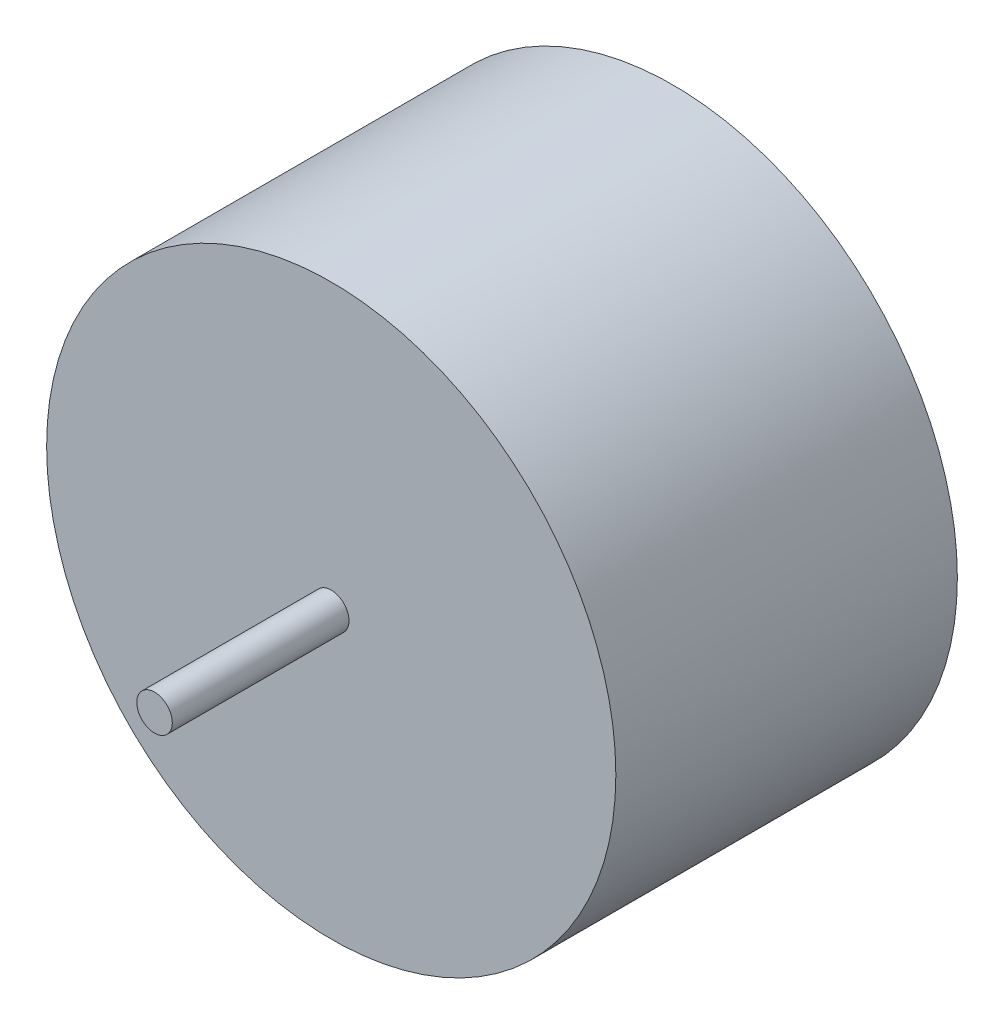
ISO-10303-21;
HEADER;
FILE_DESCRIPTION(('STEP AP214'),'2;1');
FILE_NAME('part.step','',(''),(''),'','','');
FILE_SCHEMA(('AUTOMOTIVE_DESIGN { 1 0 10303 214 1 1 1 1 }'));
ENDSEC;
DATA;
#1=APPLICATION_CONTEXT('core data for automotive mechanical design processes');
#2=APPLICATION_PROTOCOL_DEFINITION('international standard','automotive_design',2000,#1);
#3=PRODUCT_CONTEXT('',#1,'mechanical');
#4=PRODUCT('Part','Part','',(#3));
#5=PRODUCT_RELATED_PRODUCT_CATEGORY('part','',(#4));
#6=PRODUCT_DEFINITION_FORMATION('','',#4);
#7=PRODUCT_DEFINITION_CONTEXT('part definition',#1,'design');
#8=PRODUCT_DEFINITION('design','',#6,#7);
#9=PRODUCT_DEFINITION_SHAPE('','',#8);
#10=(LENGTH_UNIT() NAMED_UNIT(*) SI_UNIT(.MILLI.,.METRE.));
#11=(NAMED_UNIT(*) PLANE_ANGLE_UNIT() SI_UNIT($,.RADIAN.));
#12=(NAMED_UNIT(*) SI_UNIT($,.STERADIAN.) SOLID_ANGLE_UNIT());
#13=UNCERTAINTY_MEASURE_WITH_UNIT(LENGTH_MEASURE(1.E-05),#10,'distance_accuracy_value','');
#14=(GEOMETRIC_REPRESENTATION_CONTEXT(3) GLOBAL_UNCERTAINTY_ASSIGNED_CONTEXT((#13)) GLOBAL_UNIT_ASSIGNED_CONTEXT((#10,
#11,#12)) REPRESENTATION_CONTEXT('',''));
#15=CARTESIAN_POINT('',(0.,0.,0.));
#16=DIRECTION('',(0.,0.,1.));
#17=DIRECTION('',(1.,0.,0.));
#18=AXIS2_PLACEMENT_3D('',#15,#16,#17);
#19=CARTESIAN_POINT('',(0.,0.,28.9052));
#20=DIRECTION('',(0.,0.,-1.));
#21=DIRECTION('',(-1.,0.,0.));
#22=AXIS2_PLACEMENT_3D('',#19,#20,#21);
#23=CYLINDRICAL_SURFACE('',#22,15.875);
#24=CARTESIAN_POINT('',(0.,0.,0.));
#25=DIRECTION('',(0.,0.,1.));
#26=DIRECTION('',(1.,0.,0.));
#27=AXIS2_PLACEMENT_3D('',#24,#25,#26);
#28=CIRCLE('',#27,15.875);
#29=CARTESIAN_POINT('',(15.875,0.,0.));
#30=VERTEX_POINT('',#29);
#31=EDGE_CURVE('E11',#30,#30,#28,.T.);
#32=ORIENTED_EDGE('',*,*,#31,.T.);
#33=EDGE_LOOP('',(#32));
#34=FACE_BOUND('',#33,.T.);
#35=CARTESIAN_POINT('',(0.,0.,19.05));
#36=DIRECTION('',(0.,0.,1.));
#37=DIRECTION('',(1.,0.,0.));
#38=AXIS2_PLACEMENT_3D('',#35,#36,#37);
#39=CIRCLE('',#38,15.875);
#40=CARTESIAN_POINT('',(15.875,0.,19.05));
#41=VERTEX_POINT('',#40);
#42=EDGE_CURVE('E47',#41,#41,#39,.T.);
#43=ORIENTED_EDGE('',*,*,#42,.F.);
#44=EDGE_LOOP('',(#43));
#45=FACE_BOUND('',#44,.T.);
#46=ADVANCED_FACE('F44',(#34,#45),#23,.T.);
#47=CARTESIAN_POINT('',(0.,0.,0.));
#48=DIRECTION('',(0.,0.,1.));
#49=DIRECTION('',(1.,0.,0.));
#50=AXIS2_PLACEMENT_3D('',#47,#48,#49);
#51=PLANE('',#50);
#52=ORIENTED_EDGE('',*,*,#31,.F.);
#53=EDGE_LOOP('',(#52));
#54=FACE_BOUND('',#53,.T.);
#55=ADVANCED_FACE('F74',(#54),#51,.F.);
#56=CARTESIAN_POINT('',(0.,0.,19.05));
#57=DIRECTION('',(0.,0.,1.));
#58=DIRECTION('',(1.,0.,0.));
#59=AXIS2_PLACEMENT_3D('',#56,#57,#58);
#60=PLANE('',#59);
#61=CARTESIAN_POINT('',(0.,0.,19.05));
#62=DIRECTION('',(0.,0.,1.));
#63=DIRECTION('',(1.,0.,0.));
#64=AXIS2_PLACEMENT_3D('',#61,#62,#63);
#65=CIRCLE('',#64,0.9906);
#66=CARTESIAN_POINT('',(0.990599999999986,0.,19.05));
#67=VERTEX_POINT('',#66);
#68=EDGE_CURVE('E57',#67,#67,#65,.T.);
#69=ORIENTED_EDGE('',*,*,#68,.F.);
#70=EDGE_LOOP('',(#69));
#71=FACE_BOUND('',#70,.T.);
#72=ORIENTED_EDGE('',*,*,#42,.T.);
#73=EDGE_LOOP('',(#72));
#74=FACE_BOUND('',#73,.T.);
#75=ADVANCED_FACE('F71',(#71,#74),#60,.T.);
#76=CARTESIAN_POINT('',(0.,0.,19.05));
#77=DIRECTION('',(0.,0.,1.));
#78=DIRECTION('',(1.,0.,0.));
#79=AXIS2_PLACEMENT_3D('',#76,#77,#78);
#80=CYLINDRICAL_SURFACE('',#79,0.9906);
#81=ORIENTED_EDGE('',*,*,#68,.T.);
#82=EDGE_LOOP('',(#81));
#83=FACE_BOUND('',#82,.T.);
#84=CARTESIAN_POINT('',(0.,0.,28.9052));
#85=DIRECTION('',(0.,0.,1.));
#86=DIRECTION('',(1.,0.,0.));
#87=AXIS2_PLACEMENT_3D('',#84,#85,#86);
#88=CIRCLE('',#87,0.9906);
#89=CARTESIAN_POINT('',(0.990599999999986,0.,28.9052));
#90=VERTEX_POINT('',#89);
#91=EDGE_CURVE('E59',#90,#90,#88,.T.);
#92=ORIENTED_EDGE('',*,*,#91,.F.);
#93=EDGE_LOOP('',(#92));
#94=FACE_BOUND('',#93,.T.);
#95=ADVANCED_FACE('F68',(#83,#94),#80,.T.);
#96=CARTESIAN_POINT('',(0.,0.,28.9052));
#97=DIRECTION('',(0.,0.,1.));
#98=DIRECTION('',(1.,0.,0.));
#99=AXIS2_PLACEMENT_3D('',#96,#97,#98);
#100=PLANE('',#99);
#101=ORIENTED_EDGE('',*,*,#91,.T.);
#102=EDGE_LOOP('',(#101));
#103=FACE_BOUND('',#102,.T.);
#104=ADVANCED_FACE('F90',(#103),#100,.T.);
#105=CLOSED_SHELL('',(#46,#55,#75,#95,#104));
#106=MANIFOLD_SOLID_BREP('B2',#105);
#107=ADVANCED_BREP_SHAPE_REPRESENTATION('',(#18,#106),#14);
#108=SHAPE_DEFINITION_REPRESENTATION(#9,#107);
ENDSEC;
END-ISO-10303-21;
